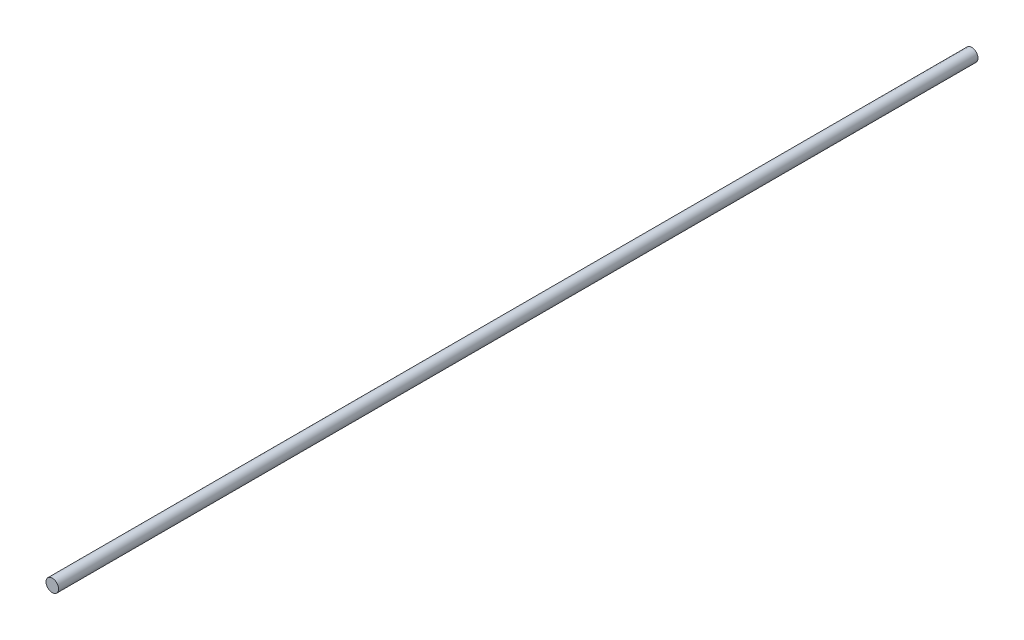
ISO-10303-21;
HEADER;
FILE_DESCRIPTION(('STEP AP214'),'2;1');
FILE_NAME('part.step','',(''),(''),'','','');
FILE_SCHEMA(('AUTOMOTIVE_DESIGN { 1 0 10303 214 1 1 1 1 }'));
ENDSEC;
DATA;
#1=APPLICATION_CONTEXT('core data for automotive mechanical design processes');
#2=APPLICATION_PROTOCOL_DEFINITION('international standard','automotive_design',2000,#1);
#3=PRODUCT_CONTEXT('',#1,'mechanical');
#4=PRODUCT('Part','Part','',(#3));
#5=PRODUCT_RELATED_PRODUCT_CATEGORY('part','',(#4));
#6=PRODUCT_DEFINITION_FORMATION('','',#4);
#7=PRODUCT_DEFINITION_CONTEXT('part definition',#1,'design');
#8=PRODUCT_DEFINITION('design','',#6,#7);
#9=PRODUCT_DEFINITION_SHAPE('','',#8);
#10=(LENGTH_UNIT() NAMED_UNIT(*) SI_UNIT(.MILLI.,.METRE.));
#11=(NAMED_UNIT(*) PLANE_ANGLE_UNIT() SI_UNIT($,.RADIAN.));
#12=(NAMED_UNIT(*) SI_UNIT($,.STERADIAN.) SOLID_ANGLE_UNIT());
#13=UNCERTAINTY_MEASURE_WITH_UNIT(LENGTH_MEASURE(1.E-05),#10,'distance_accuracy_value','');
#14=(GEOMETRIC_REPRESENTATION_CONTEXT(3) GLOBAL_UNCERTAINTY_ASSIGNED_CONTEXT((#13)) GLOBAL_UNIT_ASSIGNED_CONTEXT((#10,
#11,#12)) REPRESENTATION_CONTEXT('',''));
#15=CARTESIAN_POINT('',(0.,0.,0.));
#16=DIRECTION('',(0.,0.,1.));
#17=DIRECTION('',(1.,0.,0.));
#18=AXIS2_PLACEMENT_3D('',#15,#16,#17);
#19=CARTESIAN_POINT('',(0.,0.,182.2));
#20=DIRECTION('',(0.,0.,-1.));
#21=DIRECTION('',(-1.,0.,0.));
#22=AXIS2_PLACEMENT_3D('',#19,#20,#21);
#23=CYLINDRICAL_SURFACE('',#22,1.25);
#24=CARTESIAN_POINT('',(0.,0.,182.2));
#25=DIRECTION('',(0.,0.,1.));
#26=DIRECTION('',(1.,0.,0.));
#27=AXIS2_PLACEMENT_3D('',#24,#25,#26);
#28=CIRCLE('',#27,1.25);
#29=CARTESIAN_POINT('',(1.25,0.,182.2));
#30=VERTEX_POINT('',#29);
#31=EDGE_CURVE('E10',#30,#30,#28,.T.);
#32=ORIENTED_EDGE('',*,*,#31,.F.);
#33=EDGE_LOOP('',(#32));
#34=FACE_BOUND('',#33,.T.);
#35=CARTESIAN_POINT('',(0.,0.,0.));
#36=DIRECTION('',(0.,0.,1.));
#37=DIRECTION('',(1.,0.,0.));
#38=AXIS2_PLACEMENT_3D('',#35,#36,#37);
#39=CIRCLE('',#38,1.25);
#40=CARTESIAN_POINT('',(1.25,0.,0.));
#41=VERTEX_POINT('',#40);
#42=EDGE_CURVE('E40',#41,#41,#39,.T.);
#43=ORIENTED_EDGE('',*,*,#42,.T.);
#44=EDGE_LOOP('',(#43));
#45=FACE_BOUND('',#44,.T.);
#46=ADVANCED_FACE('F37',(#34,#45),#23,.T.);
#47=CARTESIAN_POINT('',(0.,0.,182.2));
#48=DIRECTION('',(0.,0.,1.));
#49=DIRECTION('',(1.,0.,0.));
#50=AXIS2_PLACEMENT_3D('',#47,#48,#49);
#51=PLANE('',#50);
#52=ORIENTED_EDGE('',*,*,#31,.T.);
#53=EDGE_LOOP('',(#52));
#54=FACE_BOUND('',#53,.T.);
#55=ADVANCED_FACE('F54',(#54),#51,.T.);
#56=CARTESIAN_POINT('',(0.,0.,0.));
#57=DIRECTION('',(0.,0.,1.));
#58=DIRECTION('',(1.,0.,0.));
#59=AXIS2_PLACEMENT_3D('',#56,#57,#58);
#60=PLANE('',#59);
#61=ORIENTED_EDGE('',*,*,#42,.F.);
#62=EDGE_LOOP('',(#61));
#63=FACE_BOUND('',#62,.T.);
#64=ADVANCED_FACE('F52',(#63),#60,.F.);
#65=CLOSED_SHELL('',(#46,#55,#64));
#66=MANIFOLD_SOLID_BREP('B2',#65);
#67=ADVANCED_BREP_SHAPE_REPRESENTATION('',(#18,#66),#14);
#68=SHAPE_DEFINITION_REPRESENTATION(#9,#67);
ENDSEC;
END-ISO-10303-21;
